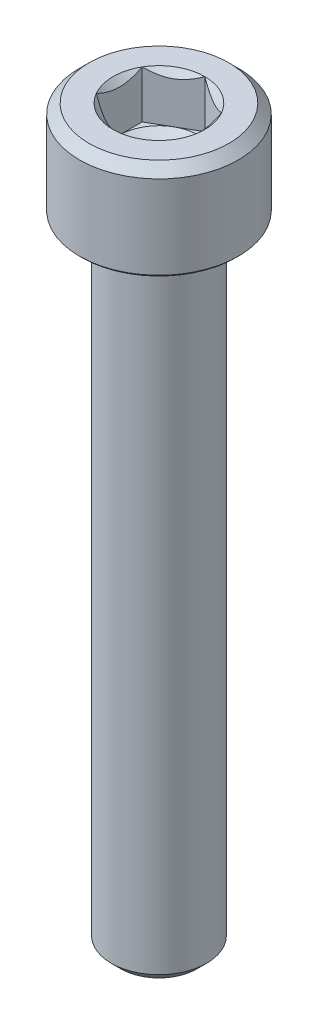
ISO-10303-21;
HEADER;
FILE_DESCRIPTION(('STEP AP214'),'2;1');
FILE_NAME('part.step','',(''),(''),'','','');
FILE_SCHEMA(('AUTOMOTIVE_DESIGN { 1 0 10303 214 1 1 1 1 }'));
ENDSEC;
DATA;
#1=APPLICATION_CONTEXT('core data for automotive mechanical design processes');
#2=APPLICATION_PROTOCOL_DEFINITION('international standard','automotive_design',2000,#1);
#3=PRODUCT_CONTEXT('',#1,'mechanical');
#4=PRODUCT('Part','Part','',(#3));
#5=PRODUCT_RELATED_PRODUCT_CATEGORY('part','',(#4));
#6=PRODUCT_DEFINITION_FORMATION('','',#4);
#7=PRODUCT_DEFINITION_CONTEXT('part definition',#1,'design');
#8=PRODUCT_DEFINITION('design','',#6,#7);
#9=PRODUCT_DEFINITION_SHAPE('','',#8);
#10=(LENGTH_UNIT() NAMED_UNIT(*) SI_UNIT(.MILLI.,.METRE.));
#11=(NAMED_UNIT(*) PLANE_ANGLE_UNIT() SI_UNIT($,.RADIAN.));
#12=(NAMED_UNIT(*) SI_UNIT($,.STERADIAN.) SOLID_ANGLE_UNIT());
#13=UNCERTAINTY_MEASURE_WITH_UNIT(LENGTH_MEASURE(1.E-05),#10,'distance_accuracy_value','');
#14=(GEOMETRIC_REPRESENTATION_CONTEXT(3) GLOBAL_UNCERTAINTY_ASSIGNED_CONTEXT((#13)) GLOBAL_UNIT_ASSIGNED_CONTEXT((#10,
#11,#12)) REPRESENTATION_CONTEXT('',''));
#15=CARTESIAN_POINT('',(0.,0.,0.));
#16=DIRECTION('',(0.,0.,1.));
#17=DIRECTION('',(1.,0.,0.));
#18=AXIS2_PLACEMENT_3D('',#15,#16,#17);
#19=CARTESIAN_POINT('',(0.,6.,0.));
#20=DIRECTION('',(0.,1.,0.));
#21=DIRECTION('',(0.,0.,1.));
#22=AXIS2_PLACEMENT_3D('',#19,#20,#21);
#23=CONICAL_SURFACE('',#22,2.8867513459481,0.785398163397456);
#24=CARTESIAN_POINT('',(0.,6.,0.));
#25=DIRECTION('',(0.,1.,0.));
#26=DIRECTION('',(0.,0.,1.));
#27=AXIS2_PLACEMENT_3D('',#24,#25,#26);
#28=CIRCLE('',#27,2.8867513459481);
#29=CARTESIAN_POINT('',(-2.5,6.,-1.4433756729741));
#30=VERTEX_POINT('',#29);
#31=CARTESIAN_POINT('',(-2.49999999999992,6.,1.44337567297415));
#32=VERTEX_POINT('',#31);
#33=EDGE_CURVE('E248',#30,#32,#28,.T.);
#34=ORIENTED_EDGE('',*,*,#33,.T.);
#35=CARTESIAN_POINT('',(-2.5,8.13577537813774,4.35611922405216));
#36=CARTESIAN_POINT('',(-2.5,8.02405641725015,4.22725866001411));
#37=CARTESIAN_POINT('',(-2.5,7.91298496215345,4.09782489086441));
#38=CARTESIAN_POINT('',(-2.5,7.69259879452265,3.83736651955328));
#39=CARTESIAN_POINT('',(-2.5,7.58328494304008,3.70634118973727));
#40=CARTESIAN_POINT('',(-2.5,7.36449428724606,3.43934006325916));
#41=CARTESIAN_POINT('',(-2.5,7.25507161834455,3.30331973073165));
#42=CARTESIAN_POINT('',(-2.5,7.0395504603782,3.02871290645586));
#43=CARTESIAN_POINT('',(-2.5,6.9334511449051,2.89012706652307));
#44=CARTESIAN_POINT('',(-2.5,6.72569625037669,2.60935358025564));
#45=CARTESIAN_POINT('',(-2.5,6.62404682456147,2.46716135079696));
#46=CARTESIAN_POINT('',(-2.5,6.427287032347,2.17809364419256));
#47=CARTESIAN_POINT('',(-2.5,6.33218202887991,2.03121446717299));
#48=CARTESIAN_POINT('',(-2.5,6.15259291190782,1.73256542621065));
#49=CARTESIAN_POINT('',(-2.5,6.06803248336325,1.58084206421605));
#50=CARTESIAN_POINT('',(-2.5,5.91405163519295,1.26990866786591));
#51=CARTESIAN_POINT('',(-2.5,5.84460335921077,1.11071307736996));
#52=CARTESIAN_POINT('',(-2.5,5.75713367176378,0.863830735911925));
#53=CARTESIAN_POINT('',(-2.5,5.73056031651565,0.779188227940742));
#54=CARTESIAN_POINT('',(-2.5,5.68477521230841,0.607910212253409));
#55=CARTESIAN_POINT('',(-2.5,5.66556228833098,0.521275024991105));
#56=CARTESIAN_POINT('',(-2.5,5.63577461402971,0.34705516730253));
#57=CARTESIAN_POINT('',(-2.5,5.62514725633831,0.259479663207399));
#58=CARTESIAN_POINT('',(-2.5,5.61311288672129,0.0836918904943055));
#59=CARTESIAN_POINT('',(-2.5,5.61170490624327,-0.00452031025996186));
#60=CARTESIAN_POINT('',(-2.5,5.61822212538001,-0.18070662873615));
#61=CARTESIAN_POINT('',(-2.5,5.62615950537358,-0.268680285623365));
#62=CARTESIAN_POINT('',(-2.5,5.65078694752077,-0.443384717226244));
#63=CARTESIAN_POINT('',(-2.5,5.66747873326786,-0.530115243734975));
#64=CARTESIAN_POINT('',(-2.5,5.70866876791725,-0.702320390459049));
#65=CARTESIAN_POINT('',(-2.5,5.73322158395551,-0.787781727344948));
#66=CARTESIAN_POINT('',(-2.5,5.78880674634178,-0.956537282986512));
#67=CARTESIAN_POINT('',(-2.5,5.81983916442738,-1.03983147773762));
#68=CARTESIAN_POINT('',(-2.5,5.89474881513279,-1.22278399037518));
#69=CARTESIAN_POINT('',(-2.5,5.93994460001276,-1.32189786118767));
#70=CARTESIAN_POINT('',(-2.5,6.03636406758992,-1.51717428919833));
#71=CARTESIAN_POINT('',(-2.5,6.08759123298228,-1.61333510041095));
#72=CARTESIAN_POINT('',(-2.5,6.19473393742918,-1.80324961470391));
#73=CARTESIAN_POINT('',(-2.5,6.25065896885281,-1.89699791868217));
#74=CARTESIAN_POINT('',(-2.5,6.36602738775938,-2.08226282648701));
#75=CARTESIAN_POINT('',(-2.5,6.42547007579179,-2.17377986890138));
#76=CARTESIAN_POINT('',(-2.5,6.54742331755106,-2.35544305197534));
#77=CARTESIAN_POINT('',(-2.5,6.60994847288604,-2.4455793449366));
#78=CARTESIAN_POINT('',(-2.5,6.73719466368044,-2.62429215374495));
#79=CARTESIAN_POINT('',(-2.5,6.80191586463738,-2.71286855126832));
#80=CARTESIAN_POINT('',(-2.5,6.99853021283148,-2.97643633428385));
#81=CARTESIAN_POINT('',(-2.5,7.13302426311341,-3.1494851470417));
#82=CARTESIAN_POINT('',(-2.5,7.41100964091682,-3.49742558299317));
#83=CARTESIAN_POINT('',(-2.5,7.55465127250707,-3.67219593456785));
#84=CARTESIAN_POINT('',(-2.5,7.77187642571596,-3.93128178305344));
#85=CARTESIAN_POINT('',(-2.5,7.84418027248009,-4.01667541105772));
#86=CARTESIAN_POINT('',(-2.5,7.98948272073258,-4.18683801333492));
#87=CARTESIAN_POINT('',(-2.5,8.06248116930565,-4.27160711812369));
#88=CARTESIAN_POINT('',(-2.5,8.13577537813774,-4.35611922405216));
#89=B_SPLINE_CURVE_WITH_KNOTS('',3,(#35,#36,#37,#38,#39,#40,#41,#42,#43,#44,#45,#46,#47,#48,#49,
#50,#51,#52,#53,#54,#55,#56,#57,#58,#59,#60,#61,#62,#63,#64,#65,#66,#67,#68,#69,#70,#71,#72,#73,
#74,#75,#76,#77,#78,#79,#80,#81,#82,#83,#84,#85,#86,#87,#88),.UNSPECIFIED.,.F.,.F.,(4,2,2,2,2,2,
2,2,2,2,2,2,2,2,2,2,2,2,2,2,2,2,2,2,2,2,4),(0.,0.511651260827456,1.02354597863305,
1.54722019644248,2.07076314295685,2.59500853626769,3.11967853721108,3.64029866615625,
4.15995084602473,4.42583268235067,4.69167205562899,4.95586989463537,5.22003997758485,
5.48455475102646,5.74912162248553,6.01556631338383,6.28201395432691,6.60853329817762,
6.93524211714085,7.26262772981267,7.58994846247615,7.91900556147622,8.24808751406502,
8.9054558787838,9.58407513821362,9.91974928830331,10.2553511756034),.UNSPECIFIED.);
#90=EDGE_CURVE('E135',#32,#30,#89,.T.);
#91=ORIENTED_EDGE('',*,*,#90,.T.);
#92=EDGE_LOOP('',(#34,#91));
#93=FACE_BOUND('',#92,.T.);
#94=ADVANCED_FACE('F43',(#93),#23,.F.);
#95=CARTESIAN_POINT('',(0.,6.,-2.8867513459481));
#96=VERTEX_POINT('',#95);
#97=EDGE_CURVE('E250',#96,#30,#28,.T.);
#98=ORIENTED_EDGE('',*,*,#97,.T.);
#99=CARTESIAN_POINT('',(-2.5002,6.00011547698181,-1.44326020292026));
#100=CARTESIAN_POINT('',(-2.41426172221223,5.95054070535477,-1.49287669073472));
#101=CARTESIAN_POINT('',(-2.32688643272424,5.90387748136255,-1.54332283764113));
#102=CARTESIAN_POINT('',(-2.1487185438344,5.81843814003834,-1.64618811625262));
#103=CARTESIAN_POINT('',(-2.05790899931891,5.77970956240604,-1.69861703122363));
#104=CARTESIAN_POINT('',(-1.87479587687306,5.71336670389778,-1.80433744175989));
#105=CARTESIAN_POINT('',(-1.78253893547063,5.68558566853089,-1.85760201171319));
#106=CARTESIAN_POINT('',(-1.59599399122368,5.6427831759107,-1.96530378549012));
#107=CARTESIAN_POINT('',(-1.50171168743368,5.62772976667138,-2.0197376989631));
#108=CARTESIAN_POINT('',(-1.33922174170811,5.61414772220952,-2.11355131286836));
#109=CARTESIAN_POINT('',(-1.2712240321198,5.61213709924084,-2.15280980880344));
#110=CARTESIAN_POINT('',(-1.13533975883073,5.61552411718752,-2.23126263056552));
#111=CARTESIAN_POINT('',(-1.06745324244771,5.62092435529986,-2.2704569290736));
#112=CARTESIAN_POINT('',(-0.932321211763838,5.63882578840251,-2.34847544336507));
#113=CARTESIAN_POINT('',(-0.865076500246381,5.65133492704652,-2.38729919566125));
#114=CARTESIAN_POINT('',(-0.731749899181739,5.68276750195575,-2.46427534467606));
#115=CARTESIAN_POINT('',(-0.665667920900279,5.70169044649686,-2.50242779262544));
#116=CARTESIAN_POINT('',(-0.496403653308682,5.75786736140828,-2.60015256308363));
#117=CARTESIAN_POINT('',(-0.394270877777065,5.79935583159622,-2.65911894852989));
#118=CARTESIAN_POINT('',(-0.244093585059466,5.86939404672311,-2.74582384890656));
#119=CARTESIAN_POINT('',(-0.19460346011737,5.89400225211609,-2.77439698586411));
#120=CARTESIAN_POINT('',(-0.096539936161143,5.94546188671524,-2.83101398781792));
#121=CARTESIAN_POINT('',(-0.0479659965030668,5.97231193877936,-2.85905816495511));
#122=CARTESIAN_POINT('',(0.000200000000000365,6.00011547698176,-2.88686681600194));
#123=B_SPLINE_CURVE_WITH_KNOTS('',3,(#99,#100,#101,#102,#103,#104,#105,#106,#107,#108,#109,#110,
#111,#112,#113,#114,#115,#116,#117,#118,#119,#120,#121,#122),.UNSPECIFIED.,.F.,.F.,(4,2,2,2,2,2,
2,2,2,2,2,4),(0.,0.333012085133933,0.667964518301415,0.997597032043327,1.32639954393848,
1.56169424147173,1.79707142102087,2.03271213522176,2.26833478775656,2.64260240809534,
2.82922877818862,3.01574133749021),.UNSPECIFIED.);
#124=EDGE_CURVE('E210',#30,#96,#123,.T.);
#125=ORIENTED_EDGE('',*,*,#124,.T.);
#126=EDGE_LOOP('',(#98,#125));
#127=FACE_BOUND('',#126,.T.);
#128=ADVANCED_FACE('F294',(#127),#23,.F.);
#129=CARTESIAN_POINT('',(2.5,6.,-1.4433756729741));
#130=VERTEX_POINT('',#129);
#131=EDGE_CURVE('E247',#130,#96,#28,.T.);
#132=ORIENTED_EDGE('',*,*,#131,.T.);
#133=CARTESIAN_POINT('',(-0.000200000000000024,6.00011547698176,-2.88686681600194));
#134=CARTESIAN_POINT('',(0.0857382777877633,5.95054070535473,-2.83725032818748));
#135=CARTESIAN_POINT('',(0.17311356727575,5.90387748136251,-2.78680418128107));
#136=CARTESIAN_POINT('',(0.351281456165583,5.81843814003831,-2.68393890266959));
#137=CARTESIAN_POINT('',(0.442091000681067,5.77970956240602,-2.63150998769859));
#138=CARTESIAN_POINT('',(0.62520412312691,5.71336670389776,-2.52578957716233));
#139=CARTESIAN_POINT('',(0.717461064529327,5.68558566853088,-2.47252500720904));
#140=CARTESIAN_POINT('',(0.904006008776268,5.6427831759107,-2.36482323343211));
#141=CARTESIAN_POINT('',(0.998288312566263,5.62772976667138,-2.31038931995914));
#142=CARTESIAN_POINT('',(1.16077825829182,5.61414772220952,-2.21657570605388));
#143=CARTESIAN_POINT('',(1.22877596788013,5.61213709924084,-2.1773172101188));
#144=CARTESIAN_POINT('',(1.3646602411692,5.61552411718753,-2.09886438835672));
#145=CARTESIAN_POINT('',(1.43254675755222,5.62092435529986,-2.05967008984863));
#146=CARTESIAN_POINT('',(1.56767878823609,5.63882578840251,-1.98165157555716));
#147=CARTESIAN_POINT('',(1.63492349975355,5.65133492704652,-1.94282782326098));
#148=CARTESIAN_POINT('',(1.76825010081819,5.68276750195575,-1.86585167424618));
#149=CARTESIAN_POINT('',(1.83433207909965,5.70169044649686,-1.8276992262968));
#150=CARTESIAN_POINT('',(2.00359634669126,5.75786736140829,-1.7299744558386));
#151=CARTESIAN_POINT('',(2.10572912222289,5.79935583159623,-1.67100807039233));
#152=CARTESIAN_POINT('',(2.25590641494051,5.86939404672313,-1.58430317001565));
#153=CARTESIAN_POINT('',(2.30539653988261,5.89400225211612,-1.5557300330581));
#154=CARTESIAN_POINT('',(2.40346006383885,5.94546188671528,-1.49911303110429));
#155=CARTESIAN_POINT('',(2.45203400349693,5.9723119387794,-1.4710688539671));
#156=CARTESIAN_POINT('',(2.5002,6.00011547698181,-1.44326020292026));
#157=B_SPLINE_CURVE_WITH_KNOTS('',3,(#133,#134,#135,#136,#137,#138,#139,#140,#141,#142,#143,
#144,#145,#146,#147,#148,#149,#150,#151,#152,#153,#154,#155,#156),.UNSPECIFIED.,.F.,.F.,(4,2,2,
2,2,2,2,2,2,2,2,4),(0.,0.333012085133912,0.667964518301373,0.997597032043263,1.32639954393839,
1.56169424147164,1.79707142102078,2.03271213522167,2.26833478775647,2.64260240809529,
2.8292287781886,3.01574133749021),.UNSPECIFIED.);
#158=EDGE_CURVE('E261',#96,#130,#157,.T.);
#159=ORIENTED_EDGE('',*,*,#158,.T.);
#160=EDGE_LOOP('',(#132,#159));
#161=FACE_BOUND('',#160,.T.);
#162=ADVANCED_FACE('F259',(#161),#23,.F.);
#163=CARTESIAN_POINT('',(2.5,6.,1.4433756729741));
#164=VERTEX_POINT('',#163);
#165=EDGE_CURVE('E242',#164,#130,#28,.T.);
#166=ORIENTED_EDGE('',*,*,#165,.T.);
#167=CARTESIAN_POINT('',(2.5,8.13577537813774,-4.35611922405216));
#168=CARTESIAN_POINT('',(2.5,8.02405641725015,-4.22725866001411));
#169=CARTESIAN_POINT('',(2.5,7.91298496215345,-4.09782489086441));
#170=CARTESIAN_POINT('',(2.5,7.69259879452265,-3.83736651955328));
#171=CARTESIAN_POINT('',(2.5,7.58328494304008,-3.70634118973727));
#172=CARTESIAN_POINT('',(2.5,7.36449428724606,-3.43934006325916));
#173=CARTESIAN_POINT('',(2.5,7.25507161834455,-3.30331973073165));
#174=CARTESIAN_POINT('',(2.5,7.0395504603782,-3.02871290645586));
#175=CARTESIAN_POINT('',(2.5,6.9334511449051,-2.89012706652307));
#176=CARTESIAN_POINT('',(2.5,6.72569625037669,-2.60935358025564));
#177=CARTESIAN_POINT('',(2.5,6.62404682456147,-2.46716135079696));
#178=CARTESIAN_POINT('',(2.5,6.427287032347,-2.17809364419256));
#179=CARTESIAN_POINT('',(2.5,6.33218202887991,-2.03121446717299));
#180=CARTESIAN_POINT('',(2.5,6.15259291190782,-1.73256542621065));
#181=CARTESIAN_POINT('',(2.5,6.06803248336325,-1.58084206421605));
#182=CARTESIAN_POINT('',(2.5,5.91405163519295,-1.26990866786591));
#183=CARTESIAN_POINT('',(2.5,5.84460335921077,-1.11071307736996));
#184=CARTESIAN_POINT('',(2.5,5.75713367176378,-0.863830735911925));
#185=CARTESIAN_POINT('',(2.5,5.73056031651565,-0.779188227940742));
#186=CARTESIAN_POINT('',(2.5,5.68477521230841,-0.607910212253409));
#187=CARTESIAN_POINT('',(2.5,5.66556228833098,-0.521275024991105));
#188=CARTESIAN_POINT('',(2.5,5.63577461402971,-0.34705516730253));
#189=CARTESIAN_POINT('',(2.5,5.62514725633831,-0.259479663207399));
#190=CARTESIAN_POINT('',(2.5,5.61311288672129,-0.0836918904943055));
#191=CARTESIAN_POINT('',(2.5,5.61170490624327,0.00452031025996186));
#192=CARTESIAN_POINT('',(2.5,5.61822212538001,0.18070662873615));
#193=CARTESIAN_POINT('',(2.5,5.62615950537358,0.268680285623365));
#194=CARTESIAN_POINT('',(2.5,5.65078694752077,0.443384717226244));
#195=CARTESIAN_POINT('',(2.5,5.66747873326786,0.530115243734975));
#196=CARTESIAN_POINT('',(2.5,5.70866876791725,0.702320390459049));
#197=CARTESIAN_POINT('',(2.5,5.73322158395551,0.787781727344948));
#198=CARTESIAN_POINT('',(2.5,5.78880674634178,0.956537282986512));
#199=CARTESIAN_POINT('',(2.5,5.81983916442738,1.03983147773762));
#200=CARTESIAN_POINT('',(2.5,5.89474881513279,1.22278399037518));
#201=CARTESIAN_POINT('',(2.5,5.93994460001276,1.32189786118767));
#202=CARTESIAN_POINT('',(2.5,6.03636406758992,1.51717428919833));
#203=CARTESIAN_POINT('',(2.5,6.08759123298228,1.61333510041095));
#204=CARTESIAN_POINT('',(2.5,6.19473393742918,1.80324961470391));
#205=CARTESIAN_POINT('',(2.5,6.25065896885281,1.89699791868217));
#206=CARTESIAN_POINT('',(2.5,6.36602738775938,2.08226282648701));
#207=CARTESIAN_POINT('',(2.5,6.42547007579179,2.17377986890138));
#208=CARTESIAN_POINT('',(2.5,6.54742331755106,2.35544305197534));
#209=CARTESIAN_POINT('',(2.5,6.60994847288604,2.4455793449366));
#210=CARTESIAN_POINT('',(2.5,6.73719466368044,2.62429215374495));
#211=CARTESIAN_POINT('',(2.5,6.80191586463738,2.71286855126832));
#212=CARTESIAN_POINT('',(2.5,6.99853021283148,2.97643633428385));
#213=CARTESIAN_POINT('',(2.5,7.13302426311341,3.1494851470417));
#214=CARTESIAN_POINT('',(2.5,7.41100964091682,3.49742558299317));
#215=CARTESIAN_POINT('',(2.5,7.55465127250707,3.67219593456785));
#216=CARTESIAN_POINT('',(2.5,7.77187642571596,3.93128178305344));
#217=CARTESIAN_POINT('',(2.5,7.84418027248009,4.01667541105772));
#218=CARTESIAN_POINT('',(2.5,7.98948272073258,4.18683801333492));
#219=CARTESIAN_POINT('',(2.5,8.06248116930565,4.27160711812369));
#220=CARTESIAN_POINT('',(2.5,8.13577537813774,4.35611922405216));
#221=B_SPLINE_CURVE_WITH_KNOTS('',3,(#167,#168,#169,#170,#171,#172,#173,#174,#175,#176,#177,
#178,#179,#180,#181,#182,#183,#184,#185,#186,#187,#188,#189,#190,#191,#192,#193,#194,#195,#196,
#197,#198,#199,#200,#201,#202,#203,#204,#205,#206,#207,#208,#209,#210,#211,#212,#213,#214,#215,
#216,#217,#218,#219,#220),.UNSPECIFIED.,.F.,.F.,(4,2,2,2,2,2,2,2,2,2,2,2,2,2,2,2,2,2,2,2,2,2,2,
2,2,2,4),(0.,0.511651260827456,1.02354597863305,1.54722019644248,2.07076314295685,
2.59500853626769,3.11967853721108,3.64029866615625,4.15995084602473,4.42583268235067,
4.69167205562899,4.95586989463537,5.22003997758485,5.48455475102646,5.74912162248553,
6.01556631338383,6.28201395432691,6.60853329817762,6.93524211714085,7.26262772981267,
7.58994846247615,7.91900556147622,8.24808751406502,8.9054558787838,9.58407513821362,
9.91974928830331,10.2553511756034),.UNSPECIFIED.);
#222=EDGE_CURVE('E269',#130,#164,#221,.T.);
#223=ORIENTED_EDGE('',*,*,#222,.T.);
#224=EDGE_LOOP('',(#166,#223));
#225=FACE_BOUND('',#224,.T.);
#226=ADVANCED_FACE('F268',(#225),#23,.F.);
#227=CARTESIAN_POINT('',(0.,6.,2.8867513459481));
#228=VERTEX_POINT('',#227);
#229=EDGE_CURVE('E240',#228,#164,#28,.T.);
#230=ORIENTED_EDGE('',*,*,#229,.T.);
#231=CARTESIAN_POINT('',(2.5002,6.00011547698181,1.44326020292026));
#232=CARTESIAN_POINT('',(2.41426172221223,5.95054070535477,1.49287669073472));
#233=CARTESIAN_POINT('',(2.32688643272424,5.90387748136255,1.54332283764113));
#234=CARTESIAN_POINT('',(2.1487185438344,5.81843814003834,1.64618811625262));
#235=CARTESIAN_POINT('',(2.05790899931891,5.77970956240604,1.69861703122363));
#236=CARTESIAN_POINT('',(1.87479587687306,5.71336670389778,1.80433744175989));
#237=CARTESIAN_POINT('',(1.78253893547063,5.68558566853089,1.85760201171319));
#238=CARTESIAN_POINT('',(1.59599399122368,5.6427831759107,1.96530378549012));
#239=CARTESIAN_POINT('',(1.50171168743368,5.62772976667138,2.0197376989631));
#240=CARTESIAN_POINT('',(1.33922174170811,5.61414772220952,2.11355131286836));
#241=CARTESIAN_POINT('',(1.2712240321198,5.61213709924084,2.15280980880344));
#242=CARTESIAN_POINT('',(1.13533975883073,5.61552411718752,2.23126263056552));
#243=CARTESIAN_POINT('',(1.06745324244771,5.62092435529986,2.2704569290736));
#244=CARTESIAN_POINT('',(0.932321211763838,5.63882578840251,2.34847544336507));
#245=CARTESIAN_POINT('',(0.865076500246381,5.65133492704652,2.38729919566125));
#246=CARTESIAN_POINT('',(0.731749899181739,5.68276750195575,2.46427534467606));
#247=CARTESIAN_POINT('',(0.665667920900279,5.70169044649686,2.50242779262544));
#248=CARTESIAN_POINT('',(0.496403653308682,5.75786736140828,2.60015256308363));
#249=CARTESIAN_POINT('',(0.394270877777065,5.79935583159622,2.65911894852989));
#250=CARTESIAN_POINT('',(0.244093585059466,5.86939404672311,2.74582384890656));
#251=CARTESIAN_POINT('',(0.19460346011737,5.89400225211609,2.77439698586411));
#252=CARTESIAN_POINT('',(0.096539936161143,5.94546188671524,2.83101398781792));
#253=CARTESIAN_POINT('',(0.0479659965030668,5.97231193877936,2.85905816495511));
#254=CARTESIAN_POINT('',(-0.000200000000000365,6.00011547698176,2.88686681600194));
#255=B_SPLINE_CURVE_WITH_KNOTS('',3,(#231,#232,#233,#234,#235,#236,#237,#238,#239,#240,#241,
#242,#243,#244,#245,#246,#247,#248,#249,#250,#251,#252,#253,#254),.UNSPECIFIED.,.F.,.F.,(4,2,2,
2,2,2,2,2,2,2,2,4),(0.,0.333012085133933,0.667964518301415,0.997597032043327,1.32639954393848,
1.56169424147173,1.79707142102087,2.03271213522176,2.26833478775656,2.64260240809534,
2.82922877818862,3.01574133749021),.UNSPECIFIED.);
#256=EDGE_CURVE('E179',#164,#228,#255,.T.);
#257=ORIENTED_EDGE('',*,*,#256,.T.);
#258=EDGE_LOOP('',(#230,#257));
#259=FACE_BOUND('',#258,.T.);
#260=ADVANCED_FACE('F299',(#259),#23,.F.);
#261=EDGE_CURVE('E239',#32,#228,#28,.T.);
#262=ORIENTED_EDGE('',*,*,#261,.T.);
#263=CARTESIAN_POINT('',(0.000200000000000024,6.00011547698176,2.88686681600194));
#264=CARTESIAN_POINT('',(-0.0857382777877633,5.95054070535473,2.83725032818748));
#265=CARTESIAN_POINT('',(-0.17311356727575,5.90387748136251,2.78680418128107));
#266=CARTESIAN_POINT('',(-0.351281456165583,5.81843814003831,2.68393890266959));
#267=CARTESIAN_POINT('',(-0.442091000681067,5.77970956240602,2.63150998769859));
#268=CARTESIAN_POINT('',(-0.62520412312691,5.71336670389776,2.52578957716233));
#269=CARTESIAN_POINT('',(-0.717461064529327,5.68558566853088,2.47252500720904));
#270=CARTESIAN_POINT('',(-0.904006008776268,5.6427831759107,2.36482323343211));
#271=CARTESIAN_POINT('',(-0.998288312566263,5.62772976667138,2.31038931995914));
#272=CARTESIAN_POINT('',(-1.16077825829182,5.61414772220952,2.21657570605388));
#273=CARTESIAN_POINT('',(-1.22877596788013,5.61213709924084,2.1773172101188));
#274=CARTESIAN_POINT('',(-1.3646602411692,5.61552411718753,2.09886438835672));
#275=CARTESIAN_POINT('',(-1.43254675755222,5.62092435529986,2.05967008984863));
#276=CARTESIAN_POINT('',(-1.56767878823609,5.63882578840251,1.98165157555716));
#277=CARTESIAN_POINT('',(-1.63492349975355,5.65133492704652,1.94282782326098));
#278=CARTESIAN_POINT('',(-1.76825010081819,5.68276750195575,1.86585167424618));
#279=CARTESIAN_POINT('',(-1.83433207909965,5.70169044649686,1.8276992262968));
#280=CARTESIAN_POINT('',(-2.00359634669126,5.75786736140829,1.7299744558386));
#281=CARTESIAN_POINT('',(-2.10572912222289,5.79935583159623,1.67100807039233));
#282=CARTESIAN_POINT('',(-2.25590641494051,5.86939404672313,1.58430317001565));
#283=CARTESIAN_POINT('',(-2.30539653988261,5.89400225211612,1.5557300330581));
#284=CARTESIAN_POINT('',(-2.40346006383885,5.94546188671528,1.49911303110429));
#285=CARTESIAN_POINT('',(-2.45203400349693,5.9723119387794,1.4710688539671));
#286=CARTESIAN_POINT('',(-2.5002,6.00011547698181,1.44326020292026));
#287=B_SPLINE_CURVE_WITH_KNOTS('',3,(#263,#264,#265,#266,#267,#268,#269,#270,#271,#272,#273,
#274,#275,#276,#277,#278,#279,#280,#281,#282,#283,#284,#285,#286),.UNSPECIFIED.,.F.,.F.,(4,2,2,
2,2,2,2,2,2,2,2,4),(0.,0.333012085133912,0.667964518301373,0.997597032043263,1.32639954393839,
1.56169424147164,1.79707142102078,2.03271213522167,2.26833478775647,2.64260240809529,
2.8292287781886,3.01574133749021),.UNSPECIFIED.);
#288=EDGE_CURVE('E66',#228,#32,#287,.T.);
#289=ORIENTED_EDGE('',*,*,#288,.T.);
#290=EDGE_LOOP('',(#262,#289));
#291=FACE_BOUND('',#290,.T.);
#292=ADVANCED_FACE('F186',(#291),#23,.F.);
#293=CARTESIAN_POINT('',(2.8867513459481,6.,0.));
#294=DIRECTION('',(0.,-1.,0.));
#295=DIRECTION('',(0.,0.,-1.));
#296=AXIS2_PLACEMENT_3D('',#293,#294,#295);
#297=PLANE('',#296);
#298=ORIENTED_EDGE('',*,*,#229,.F.);
#299=ORIENTED_EDGE('',*,*,#261,.F.);
#300=ORIENTED_EDGE('',*,*,#33,.F.);
#301=ORIENTED_EDGE('',*,*,#97,.F.);
#302=ORIENTED_EDGE('',*,*,#131,.F.);
#303=ORIENTED_EDGE('',*,*,#165,.F.);
#304=EDGE_LOOP('',(#298,#299,#300,#301,#302,#303));
#305=FACE_BOUND('',#304,.T.);
#306=CARTESIAN_POINT('',(0.,6.,0.));
#307=DIRECTION('',(0.,1.,0.));
#308=DIRECTION('',(0.,0.,1.));
#309=AXIS2_PLACEMENT_3D('',#306,#307,#308);
#310=CIRCLE('',#309,4.4);
#311=CARTESIAN_POINT('',(0.,6.,4.4));
#312=VERTEX_POINT('',#311);
#313=EDGE_CURVE('E237',#312,#312,#310,.T.);
#314=ORIENTED_EDGE('',*,*,#313,.T.);
#315=EDGE_LOOP('',(#314));
#316=FACE_BOUND('',#315,.T.);
#317=ADVANCED_FACE('F265',(#305,#316),#297,.F.);
#318=CARTESIAN_POINT('',(0.,5.4,0.));
#319=DIRECTION('',(0.,-1.,0.));
#320=DIRECTION('',(0.,0.,-1.));
#321=AXIS2_PLACEMENT_3D('',#318,#319,#320);
#322=CONICAL_SURFACE('',#321,5.,0.785398163397451);
#323=ORIENTED_EDGE('',*,*,#313,.F.);
#324=EDGE_LOOP('',(#323));
#325=FACE_BOUND('',#324,.T.);
#326=CARTESIAN_POINT('',(0.,5.4,0.));
#327=DIRECTION('',(0.,1.,0.));
#328=DIRECTION('',(0.,0.,1.));
#329=AXIS2_PLACEMENT_3D('',#326,#327,#328);
#330=CIRCLE('',#329,5.);
#331=CARTESIAN_POINT('',(0.,5.4,5.));
#332=VERTEX_POINT('',#331);
#333=EDGE_CURVE('E234',#332,#332,#330,.T.);
#334=ORIENTED_EDGE('',*,*,#333,.T.);
#335=EDGE_LOOP('',(#334));
#336=FACE_BOUND('',#335,.T.);
#337=ADVANCED_FACE('F304',(#325,#336),#322,.T.);
#338=CARTESIAN_POINT('',(0.,-40.,0.));
#339=DIRECTION('',(0.,1.,0.));
#340=DIRECTION('',(0.,0.,1.));
#341=AXIS2_PLACEMENT_3D('',#338,#339,#340);
#342=CYLINDRICAL_SURFACE('',#341,5.);
#343=ORIENTED_EDGE('',*,*,#333,.F.);
#344=EDGE_LOOP('',(#343));
#345=FACE_BOUND('',#344,.T.);
#346=CARTESIAN_POINT('',(0.,0.149999999999997,0.));
#347=DIRECTION('',(0.,1.,0.));
#348=DIRECTION('',(0.,0.,1.));
#349=AXIS2_PLACEMENT_3D('',#346,#347,#348);
#350=CIRCLE('',#349,5.);
#351=CARTESIAN_POINT('',(0.,0.149999999999997,5.));
#352=VERTEX_POINT('',#351);
#353=EDGE_CURVE('E231',#352,#352,#350,.T.);
#354=ORIENTED_EDGE('',*,*,#353,.T.);
#355=EDGE_LOOP('',(#354));
#356=FACE_BOUND('',#355,.T.);
#357=ADVANCED_FACE('F382',(#345,#356),#342,.T.);
#358=CARTESIAN_POINT('',(0.,0.,0.));
#359=DIRECTION('',(0.,1.,0.));
#360=DIRECTION('',(0.,0.,1.));
#361=AXIS2_PLACEMENT_3D('',#358,#359,#360);
#362=CONICAL_SURFACE('',#361,4.85,0.785398163397457);
#363=ORIENTED_EDGE('',*,*,#353,.F.);
#364=EDGE_LOOP('',(#363));
#365=FACE_BOUND('',#364,.T.);
#366=CARTESIAN_POINT('',(0.,0.,0.));
#367=DIRECTION('',(0.,1.,0.));
#368=DIRECTION('',(0.,0.,1.));
#369=AXIS2_PLACEMENT_3D('',#366,#367,#368);
#370=CIRCLE('',#369,4.85);
#371=CARTESIAN_POINT('',(0.,0.,4.85));
#372=VERTEX_POINT('',#371);
#373=EDGE_CURVE('E228',#372,#372,#370,.T.);
#374=ORIENTED_EDGE('',*,*,#373,.T.);
#375=EDGE_LOOP('',(#374));
#376=FACE_BOUND('',#375,.T.);
#377=ADVANCED_FACE('F386',(#365,#376),#362,.T.);
#378=CARTESIAN_POINT('',(4.85,0.,0.));
#379=DIRECTION('',(0.,1.,0.));
#380=DIRECTION('',(0.,0.,1.));
#381=AXIS2_PLACEMENT_3D('',#378,#379,#380);
#382=PLANE('',#381);
#383=ORIENTED_EDGE('',*,*,#373,.F.);
#384=EDGE_LOOP('',(#383));
#385=FACE_BOUND('',#384,.T.);
#386=CARTESIAN_POINT('',(0.,0.,0.));
#387=DIRECTION('',(0.,1.,0.));
#388=DIRECTION('',(0.,0.,1.));
#389=AXIS2_PLACEMENT_3D('',#386,#387,#388);
#390=CIRCLE('',#389,3.05);
#391=CARTESIAN_POINT('',(0.,0.,3.05));
#392=VERTEX_POINT('',#391);
#393=EDGE_CURVE('E225',#392,#392,#390,.T.);
#394=ORIENTED_EDGE('',*,*,#393,.T.);
#395=EDGE_LOOP('',(#394));
#396=FACE_BOUND('',#395,.T.);
#397=ADVANCED_FACE('F442',(#385,#396),#382,.F.);
#398=CARTESIAN_POINT('',(0.,-0.68,0.));
#399=DIRECTION('',(0.,1.,0.));
#400=DIRECTION('',(0.,0.,1.));
#401=AXIS2_PLACEMENT_3D('',#398,#399,#400);
#402=CONICAL_SURFACE('',#401,3.,0.0733973259016112);
#403=ORIENTED_EDGE('',*,*,#393,.F.);
#404=EDGE_LOOP('',(#403));
#405=FACE_BOUND('',#404,.T.);
#406=CARTESIAN_POINT('',(0.,-0.68,0.));
#407=DIRECTION('',(0.,1.,0.));
#408=DIRECTION('',(0.,0.,1.));
#409=AXIS2_PLACEMENT_3D('',#406,#407,#408);
#410=CIRCLE('',#409,3.);
#411=CARTESIAN_POINT('',(0.,-0.68,3.));
#412=VERTEX_POINT('',#411);
#413=EDGE_CURVE('E222',#412,#412,#410,.T.);
#414=ORIENTED_EDGE('',*,*,#413,.T.);
#415=EDGE_LOOP('',(#414));
#416=FACE_BOUND('',#415,.T.);
#417=ADVANCED_FACE('F431',(#405,#416),#402,.T.);
#418=CARTESIAN_POINT('',(0.,-40.,0.));
#419=DIRECTION('',(0.,1.,0.));
#420=DIRECTION('',(0.,0.,1.));
#421=AXIS2_PLACEMENT_3D('',#418,#419,#420);
#422=CYLINDRICAL_SURFACE('',#421,3.);
#423=ORIENTED_EDGE('',*,*,#413,.F.);
#424=EDGE_LOOP('',(#423));
#425=FACE_BOUND('',#424,.T.);
#426=CARTESIAN_POINT('',(0.,-39.3865,0.));
#427=DIRECTION('',(0.,1.,0.));
#428=DIRECTION('',(0.,0.,1.));
#429=AXIS2_PLACEMENT_3D('',#426,#427,#428);
#430=CIRCLE('',#429,3.);
#431=CARTESIAN_POINT('',(0.,-39.3865,3.));
#432=VERTEX_POINT('',#431);
#433=EDGE_CURVE('E219',#432,#432,#430,.T.);
#434=ORIENTED_EDGE('',*,*,#433,.T.);
#435=EDGE_LOOP('',(#434));
#436=FACE_BOUND('',#435,.T.);
#437=ADVANCED_FACE('F325',(#425,#436),#422,.T.);
#438=CARTESIAN_POINT('',(0.,-40.,0.));
#439=DIRECTION('',(0.,1.,0.));
#440=DIRECTION('',(0.,0.,1.));
#441=AXIS2_PLACEMENT_3D('',#438,#439,#440);
#442=CONICAL_SURFACE('',#441,2.3865,0.785398163397446);
#443=ORIENTED_EDGE('',*,*,#433,.F.);
#444=EDGE_LOOP('',(#443));
#445=FACE_BOUND('',#444,.T.);
#446=CARTESIAN_POINT('',(0.,-40.,0.));
#447=DIRECTION('',(0.,1.,0.));
#448=DIRECTION('',(0.,0.,1.));
#449=AXIS2_PLACEMENT_3D('',#446,#447,#448);
#450=CIRCLE('',#449,2.3865);
#451=CARTESIAN_POINT('',(0.,-40.,2.3865));
#452=VERTEX_POINT('',#451);
#453=EDGE_CURVE('E209',#452,#452,#450,.T.);
#454=ORIENTED_EDGE('',*,*,#453,.T.);
#455=EDGE_LOOP('',(#454));
#456=FACE_BOUND('',#455,.T.);
#457=ADVANCED_FACE('F408',(#445,#456),#442,.T.);
#458=CARTESIAN_POINT('',(2.3865,-40.,0.));
#459=DIRECTION('',(0.,1.,0.));
#460=DIRECTION('',(0.,0.,1.));
#461=AXIS2_PLACEMENT_3D('',#458,#459,#460);
#462=PLANE('',#461);
#463=ORIENTED_EDGE('',*,*,#453,.F.);
#464=EDGE_LOOP('',(#463));
#465=FACE_BOUND('',#464,.T.);
#466=ADVANCED_FACE('F200',(#465),#462,.F.);
#467=CARTESIAN_POINT('',(0.,3.,0.));
#468=DIRECTION('',(0.,1.,0.));
#469=DIRECTION('',(0.,0.,1.));
#470=AXIS2_PLACEMENT_3D('',#467,#468,#469);
#471=PLANE('',#470);
#472=CARTESIAN_POINT('',(0.,3.,0.));
#473=DIRECTION('',(0.,1.,0.));
#474=DIRECTION('',(0.,0.,1.));
#475=AXIS2_PLACEMENT_3D('',#472,#473,#474);
#476=CIRCLE('',#475,2.5);
#477=CARTESIAN_POINT('',(-2.5,3.,0.));
#478=VERTEX_POINT('',#477);
#479=CARTESIAN_POINT('',(-1.24999999999996,3.,2.16506350946112));
#480=VERTEX_POINT('',#479);
#481=EDGE_CURVE('E125',#478,#480,#476,.T.);
#482=ORIENTED_EDGE('',*,*,#481,.F.);
#483=DIRECTION('',(0.,0.,1.));
#484=VECTOR('',#483,1.);
#485=CARTESIAN_POINT('',(-2.5,3.,-1.4433756729741));
#486=LINE('',#485,#484);
#487=CARTESIAN_POINT('',(-2.5,3.,1.4433756729741));
#488=VERTEX_POINT('',#487);
#489=EDGE_CURVE('E119',#478,#488,#486,.T.);
#490=ORIENTED_EDGE('',*,*,#489,.T.);
#491=DIRECTION('',(0.866025403784448,0.,0.499999999999983));
#492=VECTOR('',#491,1.);
#493=CARTESIAN_POINT('',(-2.5,3.,1.4433756729741));
#494=LINE('',#493,#492);
#495=EDGE_CURVE('E123',#488,#480,#494,.T.);
#496=ORIENTED_EDGE('',*,*,#495,.T.);
#497=EDGE_LOOP('',(#482,#490,#496));
#498=FACE_BOUND('',#497,.T.);
#499=ADVANCED_FACE('F121',(#498),#471,.T.);
#500=CARTESIAN_POINT('',(-1.24999999999996,3.,-2.16506350946112));
#501=VERTEX_POINT('',#500);
#502=EDGE_CURVE('E532',#501,#478,#476,.T.);
#503=ORIENTED_EDGE('',*,*,#502,.F.);
#504=DIRECTION('',(-0.866025403784448,0.,0.499999999999983));
#505=VECTOR('',#504,1.);
#506=CARTESIAN_POINT('',(0.,3.,-2.8867513459481));
#507=LINE('',#506,#505);
#508=CARTESIAN_POINT('',(-2.5,3.,-1.4433756729741));
#509=VERTEX_POINT('',#508);
#510=EDGE_CURVE('E157',#501,#509,#507,.T.);
#511=ORIENTED_EDGE('',*,*,#510,.T.);
#512=EDGE_CURVE('E129',#509,#478,#486,.T.);
#513=ORIENTED_EDGE('',*,*,#512,.T.);
#514=EDGE_LOOP('',(#503,#511,#513));
#515=FACE_BOUND('',#514,.T.);
#516=ADVANCED_FACE('F292',(#515),#471,.T.);
#517=CARTESIAN_POINT('',(1.24999999999996,3.,-2.16506350946112));
#518=VERTEX_POINT('',#517);
#519=EDGE_CURVE('E531',#518,#501,#476,.T.);
#520=ORIENTED_EDGE('',*,*,#519,.F.);
#521=DIRECTION('',(-0.866025403784448,0.,-0.499999999999983));
#522=VECTOR('',#521,1.);
#523=CARTESIAN_POINT('',(2.5,3.,-1.4433756729741));
#524=LINE('',#523,#522);
#525=CARTESIAN_POINT('',(0.,3.,-2.8867513459481));
#526=VERTEX_POINT('',#525);
#527=EDGE_CURVE('E153',#518,#526,#524,.T.);
#528=ORIENTED_EDGE('',*,*,#527,.T.);
#529=EDGE_CURVE('E139',#526,#501,#507,.T.);
#530=ORIENTED_EDGE('',*,*,#529,.T.);
#531=EDGE_LOOP('',(#520,#528,#530));
#532=FACE_BOUND('',#531,.T.);
#533=ADVANCED_FACE('F476',(#532),#471,.T.);
#534=CARTESIAN_POINT('',(2.5,3.,0.));
#535=VERTEX_POINT('',#534);
#536=EDGE_CURVE('E51',#535,#518,#476,.T.);
#537=ORIENTED_EDGE('',*,*,#536,.F.);
#538=DIRECTION('',(0.,0.,-1.));
#539=VECTOR('',#538,1.);
#540=CARTESIAN_POINT('',(2.5,3.,1.4433756729741));
#541=LINE('',#540,#539);
#542=CARTESIAN_POINT('',(2.5,3.,-1.4433756729741));
#543=VERTEX_POINT('',#542);
#544=EDGE_CURVE('E149',#535,#543,#541,.T.);
#545=ORIENTED_EDGE('',*,*,#544,.T.);
#546=EDGE_CURVE('E154',#543,#518,#524,.T.);
#547=ORIENTED_EDGE('',*,*,#546,.T.);
#548=EDGE_LOOP('',(#537,#545,#547));
#549=FACE_BOUND('',#548,.T.);
#550=ADVANCED_FACE('F290',(#549),#471,.T.);
#551=CARTESIAN_POINT('',(1.24999999999996,3.,2.16506350946112));
#552=VERTEX_POINT('',#551);
#553=EDGE_CURVE('E11',#552,#535,#476,.T.);
#554=ORIENTED_EDGE('',*,*,#553,.F.);
#555=DIRECTION('',(0.866025403784448,0.,-0.499999999999983));
#556=VECTOR('',#555,1.);
#557=CARTESIAN_POINT('',(0.,3.,2.8867513459481));
#558=LINE('',#557,#556);
#559=CARTESIAN_POINT('',(2.5,3.,1.4433756729741));
#560=VERTEX_POINT('',#559);
#561=EDGE_CURVE('E145',#552,#560,#558,.T.);
#562=ORIENTED_EDGE('',*,*,#561,.T.);
#563=EDGE_CURVE('E150',#560,#535,#541,.T.);
#564=ORIENTED_EDGE('',*,*,#563,.T.);
#565=EDGE_LOOP('',(#554,#562,#564));
#566=FACE_BOUND('',#565,.T.);
#567=ADVANCED_FACE('F280',(#566),#471,.T.);
#568=EDGE_CURVE('E52',#480,#552,#476,.T.);
#569=ORIENTED_EDGE('',*,*,#568,.F.);
#570=CARTESIAN_POINT('',(0.,3.,2.8867513459481));
#571=VERTEX_POINT('',#570);
#572=EDGE_CURVE('E144',#480,#571,#494,.T.);
#573=ORIENTED_EDGE('',*,*,#572,.T.);
#574=EDGE_CURVE('E59',#571,#552,#558,.T.);
#575=ORIENTED_EDGE('',*,*,#574,.T.);
#576=EDGE_LOOP('',(#569,#573,#575));
#577=FACE_BOUND('',#576,.T.);
#578=ADVANCED_FACE('F199',(#577),#471,.T.);
#579=CARTESIAN_POINT('',(-2.5,3.,-1.4433756729741));
#580=DIRECTION('',(-1.,0.,0.));
#581=DIRECTION('',(0.,0.,1.));
#582=AXIS2_PLACEMENT_3D('',#579,#580,#581);
#583=PLANE('',#582);
#584=ORIENTED_EDGE('',*,*,#90,.F.);
#585=DIRECTION('',(0.,1.,0.));
#586=VECTOR('',#585,1.);
#587=CARTESIAN_POINT('',(-2.5,3.,1.4433756729741));
#588=LINE('',#587,#586);
#589=EDGE_CURVE('E132',#488,#32,#588,.T.);
#590=ORIENTED_EDGE('',*,*,#589,.F.);
#591=ORIENTED_EDGE('',*,*,#489,.F.);
#592=ORIENTED_EDGE('',*,*,#512,.F.);
#593=DIRECTION('',(0.,1.,0.));
#594=VECTOR('',#593,1.);
#595=CARTESIAN_POINT('',(-2.5,3.,-1.4433756729741));
#596=LINE('',#595,#594);
#597=EDGE_CURVE('E160',#509,#30,#596,.T.);
#598=ORIENTED_EDGE('',*,*,#597,.T.);
#599=EDGE_LOOP('',(#584,#590,#591,#592,#598));
#600=FACE_BOUND('',#599,.T.);
#601=ADVANCED_FACE('F133',(#600),#583,.F.);
#602=CARTESIAN_POINT('',(0.,3.,-2.8867513459481));
#603=DIRECTION('',(-0.499999999999983,0.,-0.866025403784448));
#604=DIRECTION('',(-0.866025403784448,0.,0.499999999999983));
#605=AXIS2_PLACEMENT_3D('',#602,#603,#604);
#606=PLANE('',#605);
#607=ORIENTED_EDGE('',*,*,#124,.F.);
#608=ORIENTED_EDGE('',*,*,#597,.F.);
#609=ORIENTED_EDGE('',*,*,#510,.F.);
#610=ORIENTED_EDGE('',*,*,#529,.F.);
#611=DIRECTION('',(0.,1.,0.));
#612=VECTOR('',#611,1.);
#613=CARTESIAN_POINT('',(0.,3.,-2.8867513459481));
#614=LINE('',#613,#612);
#615=EDGE_CURVE('E162',#526,#96,#614,.T.);
#616=ORIENTED_EDGE('',*,*,#615,.T.);
#617=EDGE_LOOP('',(#607,#608,#609,#610,#616));
#618=FACE_BOUND('',#617,.T.);
#619=ADVANCED_FACE('F198',(#618),#606,.F.);
#620=CARTESIAN_POINT('',(2.5,3.,-1.4433756729741));
#621=DIRECTION('',(0.499999999999983,0.,-0.866025403784448));
#622=DIRECTION('',(-0.866025403784448,0.,-0.499999999999983));
#623=AXIS2_PLACEMENT_3D('',#620,#621,#622);
#624=PLANE('',#623);
#625=ORIENTED_EDGE('',*,*,#158,.F.);
#626=ORIENTED_EDGE('',*,*,#615,.F.);
#627=ORIENTED_EDGE('',*,*,#527,.F.);
#628=ORIENTED_EDGE('',*,*,#546,.F.);
#629=DIRECTION('',(0.,1.,0.));
#630=VECTOR('',#629,1.);
#631=CARTESIAN_POINT('',(2.5,3.,-1.4433756729741));
#632=LINE('',#631,#630);
#633=EDGE_CURVE('E165',#543,#130,#632,.T.);
#634=ORIENTED_EDGE('',*,*,#633,.T.);
#635=EDGE_LOOP('',(#625,#626,#627,#628,#634));
#636=FACE_BOUND('',#635,.T.);
#637=ADVANCED_FACE('F332',(#636),#624,.F.);
#638=CARTESIAN_POINT('',(2.5,3.,1.4433756729741));
#639=DIRECTION('',(1.,0.,0.));
#640=DIRECTION('',(0.,0.,-1.));
#641=AXIS2_PLACEMENT_3D('',#638,#639,#640);
#642=PLANE('',#641);
#643=ORIENTED_EDGE('',*,*,#222,.F.);
#644=ORIENTED_EDGE('',*,*,#633,.F.);
#645=ORIENTED_EDGE('',*,*,#544,.F.);
#646=ORIENTED_EDGE('',*,*,#563,.F.);
#647=DIRECTION('',(0.,1.,0.));
#648=VECTOR('',#647,1.);
#649=CARTESIAN_POINT('',(2.5,3.,1.4433756729741));
#650=LINE('',#649,#648);
#651=EDGE_CURVE('E168',#560,#164,#650,.T.);
#652=ORIENTED_EDGE('',*,*,#651,.T.);
#653=EDGE_LOOP('',(#643,#644,#645,#646,#652));
#654=FACE_BOUND('',#653,.T.);
#655=ADVANCED_FACE('F276',(#654),#642,.F.);
#656=CARTESIAN_POINT('',(0.,3.,2.8867513459481));
#657=DIRECTION('',(0.499999999999983,0.,0.866025403784448));
#658=DIRECTION('',(0.866025403784448,0.,-0.499999999999983));
#659=AXIS2_PLACEMENT_3D('',#656,#657,#658);
#660=PLANE('',#659);
#661=ORIENTED_EDGE('',*,*,#256,.F.);
#662=ORIENTED_EDGE('',*,*,#651,.F.);
#663=ORIENTED_EDGE('',*,*,#561,.F.);
#664=ORIENTED_EDGE('',*,*,#574,.F.);
#665=DIRECTION('',(0.,1.,0.));
#666=VECTOR('',#665,1.);
#667=CARTESIAN_POINT('',(0.,3.,2.8867513459481));
#668=LINE('',#667,#666);
#669=EDGE_CURVE('E138',#571,#228,#668,.T.);
#670=ORIENTED_EDGE('',*,*,#669,.T.);
#671=EDGE_LOOP('',(#661,#662,#663,#664,#670));
#672=FACE_BOUND('',#671,.T.);
#673=ADVANCED_FACE('F192',(#672),#660,.F.);
#674=CARTESIAN_POINT('',(-2.5,3.,1.4433756729741));
#675=DIRECTION('',(-0.499999999999983,0.,0.866025403784448));
#676=DIRECTION('',(0.866025403784448,0.,0.499999999999983));
#677=AXIS2_PLACEMENT_3D('',#674,#675,#676);
#678=PLANE('',#677);
#679=ORIENTED_EDGE('',*,*,#288,.F.);
#680=ORIENTED_EDGE('',*,*,#669,.F.);
#681=ORIENTED_EDGE('',*,*,#572,.F.);
#682=ORIENTED_EDGE('',*,*,#495,.F.);
#683=ORIENTED_EDGE('',*,*,#589,.T.);
#684=EDGE_LOOP('',(#679,#680,#681,#682,#683));
#685=FACE_BOUND('',#684,.T.);
#686=ADVANCED_FACE('F142',(#685),#678,.F.);
#687=CARTESIAN_POINT('',(0.,3.,0.));
#688=DIRECTION('',(0.,1.,0.));
#689=DIRECTION('',(0.,0.,1.));
#690=AXIS2_PLACEMENT_3D('',#687,#688,#689);
#691=CONICAL_SURFACE('',#690,2.5,1.04719755119659);
#692=CARTESIAN_POINT('',(0.,1.5566243270259,0.));
#693=VERTEX_POINT('',#692);
#694=VERTEX_LOOP('',#693);
#695=FACE_BOUND('',#694,.T.);
#696=ORIENTED_EDGE('',*,*,#553,.T.);
#697=ORIENTED_EDGE('',*,*,#536,.T.);
#698=ORIENTED_EDGE('',*,*,#519,.T.);
#699=ORIENTED_EDGE('',*,*,#502,.T.);
#700=ORIENTED_EDGE('',*,*,#481,.T.);
#701=ORIENTED_EDGE('',*,*,#568,.T.);
#702=EDGE_LOOP('',(#696,#697,#698,#699,#700,#701));
#703=FACE_BOUND('',#702,.T.);
#704=ADVANCED_FACE('F45',(#695,#703),#691,.F.);
#705=CLOSED_SHELL('',(#94,#128,#162,#226,#260,#292,#317,#337,#357,#377,#397,#417,#437,#457,#466,
#499,#516,#533,#550,#567,#578,#601,#619,#637,#655,#673,#686,#704));
#706=MANIFOLD_SOLID_BREP('B2',#705);
#707=ADVANCED_BREP_SHAPE_REPRESENTATION('',(#18,#706),#14);
#708=SHAPE_DEFINITION_REPRESENTATION(#9,#707);
ENDSEC;
END-ISO-10303-21;
